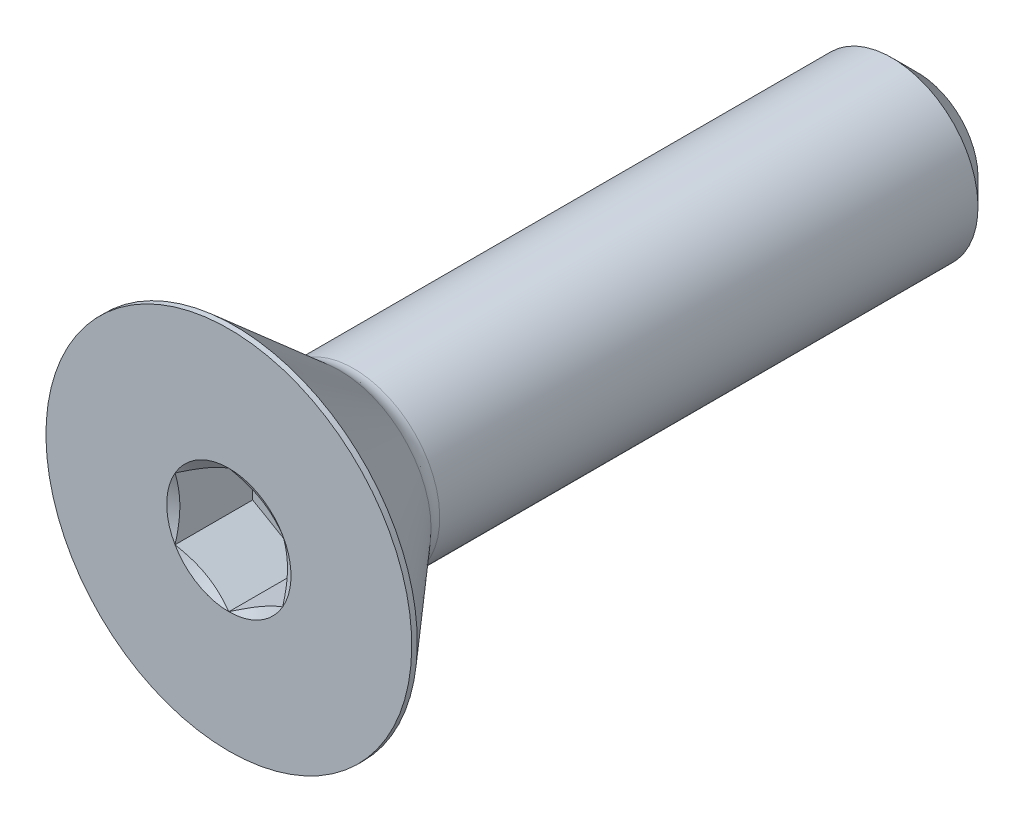
ISO-10303-21;
HEADER;
FILE_DESCRIPTION(('STEP AP214'),'2;1');
FILE_NAME('part.step','',(''),(''),'','','');
FILE_SCHEMA(('AUTOMOTIVE_DESIGN { 1 0 10303 214 1 1 1 1 }'));
ENDSEC;
DATA;
#1=APPLICATION_CONTEXT('core data for automotive mechanical design processes');
#2=APPLICATION_PROTOCOL_DEFINITION('international standard','automotive_design',2000,#1);
#3=PRODUCT_CONTEXT('',#1,'mechanical');
#4=PRODUCT('Part','Part','',(#3));
#5=PRODUCT_RELATED_PRODUCT_CATEGORY('part','',(#4));
#6=PRODUCT_DEFINITION_FORMATION('','',#4);
#7=PRODUCT_DEFINITION_CONTEXT('part definition',#1,'design');
#8=PRODUCT_DEFINITION('design','',#6,#7);
#9=PRODUCT_DEFINITION_SHAPE('','',#8);
#10=(LENGTH_UNIT() NAMED_UNIT(*) SI_UNIT(.MILLI.,.METRE.));
#11=(NAMED_UNIT(*) PLANE_ANGLE_UNIT() SI_UNIT($,.RADIAN.));
#12=(NAMED_UNIT(*) SI_UNIT($,.STERADIAN.) SOLID_ANGLE_UNIT());
#13=UNCERTAINTY_MEASURE_WITH_UNIT(LENGTH_MEASURE(1.E-05),#10,'distance_accuracy_value','');
#14=(GEOMETRIC_REPRESENTATION_CONTEXT(3) GLOBAL_UNCERTAINTY_ASSIGNED_CONTEXT((#13)) GLOBAL_UNIT_ASSIGNED_CONTEXT((#10,
#11,#12)) REPRESENTATION_CONTEXT('',''));
#15=CARTESIAN_POINT('',(0.,0.,0.));
#16=DIRECTION('',(0.,0.,1.));
#17=DIRECTION('',(1.,0.,0.));
#18=AXIS2_PLACEMENT_3D('',#15,#16,#17);
#19=CARTESIAN_POINT('',(0.,0.,-25.4));
#20=DIRECTION('',(0.,0.,-1.));
#21=DIRECTION('',(0.,1.,0.));
#22=AXIS2_PLACEMENT_3D('',#19,#20,#21);
#23=CYLINDRICAL_SURFACE('',#22,3.175);
#24=CARTESIAN_POINT('',(0.,0.,-24.4475));
#25=DIRECTION('',(0.,0.,-1.));
#26=DIRECTION('',(0.,1.,0.));
#27=AXIS2_PLACEMENT_3D('',#24,#25,#26);
#28=CIRCLE('',#27,3.175);
#29=CARTESIAN_POINT('',(0.,-3.175,-24.4475));
#30=VERTEX_POINT('',#29);
#31=EDGE_CURVE('E50',#30,#30,#28,.F.);
#32=ORIENTED_EDGE('',*,*,#31,.T.);
#33=EDGE_LOOP('',(#32));
#34=FACE_BOUND('',#33,.T.);
#35=CARTESIAN_POINT('',(0.,0.,-4.60180899712601));
#36=DIRECTION('',(0.,0.,1.));
#37=DIRECTION('',(0.,-1.,0.));
#38=AXIS2_PLACEMENT_3D('',#35,#36,#37);
#39=CIRCLE('',#38,3.175);
#40=CARTESIAN_POINT('',(0.,-3.175,-4.60180899712601));
#41=VERTEX_POINT('',#40);
#42=EDGE_CURVE('E213',#41,#41,#39,.T.);
#43=ORIENTED_EDGE('',*,*,#42,.F.);
#44=EDGE_LOOP('',(#43));
#45=FACE_BOUND('',#44,.T.);
#46=ADVANCED_FACE('F36',(#34,#45),#23,.T.);
#47=CARTESIAN_POINT('',(0.,-3.175,-25.4));
#48=DIRECTION('',(0.,0.,-1.));
#49=DIRECTION('',(0.,1.,0.));
#50=AXIS2_PLACEMENT_3D('',#47,#48,#49);
#51=PLANE('',#50);
#52=CARTESIAN_POINT('',(0.,0.,-25.4));
#53=DIRECTION('',(0.,0.,-1.));
#54=DIRECTION('',(0.,1.,0.));
#55=AXIS2_PLACEMENT_3D('',#52,#53,#54);
#56=CIRCLE('',#55,2.2225);
#57=CARTESIAN_POINT('',(0.,-2.2225,-25.4));
#58=VERTEX_POINT('',#57);
#59=EDGE_CURVE('E216',#58,#58,#56,.T.);
#60=ORIENTED_EDGE('',*,*,#59,.T.);
#61=EDGE_LOOP('',(#60));
#62=FACE_BOUND('',#61,.T.);
#63=ADVANCED_FACE('F226',(#62),#51,.T.);
#64=CARTESIAN_POINT('',(0.,0.,-25.4));
#65=DIRECTION('',(0.,0.,1.));
#66=DIRECTION('',(0.,-1.,0.));
#67=AXIS2_PLACEMENT_3D('',#64,#65,#66);
#68=CONICAL_SURFACE('',#67,2.2225,0.785398163397447);
#69=CARTESIAN_POINT('',(0.,-3.175,-24.4475));
#70=CARTESIAN_POINT('',(0.,-3.165078125,-24.457421875));
#71=CARTESIAN_POINT('',(0.,-3.15515625,-24.46734375));
#72=CARTESIAN_POINT('',(0.,-3.1353125,-24.4871875));
#73=CARTESIAN_POINT('',(0.,-3.125390625,-24.497109375));
#74=CARTESIAN_POINT('',(0.,-3.105546875,-24.516953125));
#75=CARTESIAN_POINT('',(0.,-3.095625,-24.526875));
#76=CARTESIAN_POINT('',(0.,-3.07578125,-24.54671875));
#77=CARTESIAN_POINT('',(0.,-3.065859375,-24.556640625));
#78=CARTESIAN_POINT('',(0.,-3.046015625,-24.576484375));
#79=CARTESIAN_POINT('',(0.,-3.03609375,-24.58640625));
#80=CARTESIAN_POINT('',(0.,-3.01625,-24.60625));
#81=CARTESIAN_POINT('',(0.,-3.006328125,-24.616171875));
#82=CARTESIAN_POINT('',(0.,-2.986484375,-24.636015625));
#83=CARTESIAN_POINT('',(0.,-2.9765625,-24.6459375));
#84=CARTESIAN_POINT('',(0.,-2.95671875,-24.66578125));
#85=CARTESIAN_POINT('',(0.,-2.946796875,-24.675703125));
#86=CARTESIAN_POINT('',(0.,-2.926953125,-24.695546875));
#87=CARTESIAN_POINT('',(0.,-2.91703125,-24.70546875));
#88=CARTESIAN_POINT('',(0.,-2.8971875,-24.7253125));
#89=CARTESIAN_POINT('',(0.,-2.887265625,-24.735234375));
#90=CARTESIAN_POINT('',(0.,-2.867421875,-24.755078125));
#91=CARTESIAN_POINT('',(0.,-2.8575,-24.765));
#92=CARTESIAN_POINT('',(0.,-2.83765625,-24.78484375));
#93=CARTESIAN_POINT('',(0.,-2.827734375,-24.794765625));
#94=CARTESIAN_POINT('',(0.,-2.807890625,-24.814609375));
#95=CARTESIAN_POINT('',(0.,-2.79796875,-24.82453125));
#96=CARTESIAN_POINT('',(0.,-2.778125,-24.844375));
#97=CARTESIAN_POINT('',(0.,-2.768203125,-24.854296875));
#98=CARTESIAN_POINT('',(0.,-2.748359375,-24.874140625));
#99=CARTESIAN_POINT('',(0.,-2.7384375,-24.8840625));
#100=CARTESIAN_POINT('',(0.,-2.71859375,-24.90390625));
#101=CARTESIAN_POINT('',(0.,-2.708671875,-24.913828125));
#102=CARTESIAN_POINT('',(0.,-2.688828125,-24.933671875));
#103=CARTESIAN_POINT('',(0.,-2.67890625,-24.94359375));
#104=CARTESIAN_POINT('',(0.,-2.6590625,-24.9634375));
#105=CARTESIAN_POINT('',(0.,-2.649140625,-24.973359375));
#106=CARTESIAN_POINT('',(0.,-2.629296875,-24.993203125));
#107=CARTESIAN_POINT('',(0.,-2.619375,-25.003125));
#108=CARTESIAN_POINT('',(0.,-2.59953125,-25.02296875));
#109=CARTESIAN_POINT('',(0.,-2.589609375,-25.032890625));
#110=CARTESIAN_POINT('',(0.,-2.569765625,-25.052734375));
#111=CARTESIAN_POINT('',(0.,-2.55984375,-25.06265625));
#112=CARTESIAN_POINT('',(0.,-2.54,-25.0825));
#113=CARTESIAN_POINT('',(0.,-2.530078125,-25.092421875));
#114=CARTESIAN_POINT('',(0.,-2.510234375,-25.112265625));
#115=CARTESIAN_POINT('',(0.,-2.5003125,-25.1221875));
#116=CARTESIAN_POINT('',(0.,-2.48046875,-25.14203125));
#117=CARTESIAN_POINT('',(0.,-2.470546875,-25.151953125));
#118=CARTESIAN_POINT('',(0.,-2.450703125,-25.171796875));
#119=CARTESIAN_POINT('',(0.,-2.44078125,-25.18171875));
#120=CARTESIAN_POINT('',(0.,-2.4209375,-25.2015625));
#121=CARTESIAN_POINT('',(0.,-2.411015625,-25.211484375));
#122=CARTESIAN_POINT('',(0.,-2.391171875,-25.231328125));
#123=CARTESIAN_POINT('',(0.,-2.38125,-25.24125));
#124=CARTESIAN_POINT('',(0.,-2.36140625,-25.26109375));
#125=CARTESIAN_POINT('',(0.,-2.351484375,-25.271015625));
#126=CARTESIAN_POINT('',(0.,-2.331640625,-25.290859375));
#127=CARTESIAN_POINT('',(0.,-2.32171875,-25.30078125));
#128=CARTESIAN_POINT('',(0.,-2.301875,-25.320625));
#129=CARTESIAN_POINT('',(0.,-2.291953125,-25.330546875));
#130=CARTESIAN_POINT('',(0.,-2.272109375,-25.350390625));
#131=CARTESIAN_POINT('',(0.,-2.2621875,-25.3603125));
#132=CARTESIAN_POINT('',(0.,-2.24234375,-25.38015625));
#133=CARTESIAN_POINT('',(0.,-2.232421875,-25.390078125));
#134=CARTESIAN_POINT('',(0.,-2.2225,-25.4));
#135=B_SPLINE_CURVE_WITH_KNOTS('',3,(#69,#70,#71,#72,#73,#74,#75,#76,#77,#78,#79,#80,#81,#82,
#83,#84,#85,#86,#87,#88,#89,#90,#91,#92,#93,#94,#95,#96,#97,#98,#99,#100,#101,#102,#103,#104,
#105,#106,#107,#108,#109,#110,#111,#112,#113,#114,#115,#116,#117,#118,#119,#120,#121,#122,#123,
#124,#125,#126,#127,#128,#129,#130,#131,#132,#133,#134),.UNSPECIFIED.,.F.,.F.,(4,2,2,2,2,2,2,2,
2,2,2,2,2,2,2,2,2,2,2,2,2,2,2,2,2,2,2,2,2,2,2,2,4),(0.,0.0420949505675096,0.0841899011350216,
0.126284851702534,0.168379802270046,0.210474752837558,0.252569703405068,0.29466465397258,
0.336759604540092,0.378854555107604,0.420949505675116,0.463044456242626,0.505139406810138,
0.54723435737765,0.589329307945162,0.631424258512675,0.673519209080187,0.715614159647697,
0.757709110215209,0.799804060782721,0.841899011350233,0.883993961917745,0.926088912485255,
0.968183863052767,1.01027881362028,1.05237376418779,1.0944687147553,1.13656366532281,
1.17865861589032,1.22075356645784,1.26284851702535,1.30494346759286,1.34703841816037),.UNSPECIFIED.);
#136=EDGE_CURVE('BSEAM38',#30,#58,#135,.T.);
#137=ORIENTED_EDGE('',*,*,#31,.F.);
#138=ORIENTED_EDGE('',*,*,#59,.F.);
#139=ORIENTED_EDGE('',*,*,#136,.T.);
#140=ORIENTED_EDGE('',*,*,#136,.F.);
#141=EDGE_LOOP('',(#137,#139,#138,#140));
#142=FACE_BOUND('',#141,.T.);
#143=ADVANCED_FACE('F38',(#142),#68,.T.);
#144=CARTESIAN_POINT('',(0.,0.,-4.60180899712601));
#145=DIRECTION('',(0.,0.,1.));
#146=DIRECTION('',(0.,-1.,0.));
#147=AXIS2_PLACEMENT_3D('',#144,#145,#146);
#148=TOROIDAL_SURFACE('',#147,3.95604099552516,0.781040995525161);
#149=CARTESIAN_POINT('',(0.,0.,-4.0894));
#150=DIRECTION('',(0.,0.,1.));
#151=DIRECTION('',(0.,-1.,0.));
#152=AXIS2_PLACEMENT_3D('',#149,#150,#151);
#153=CIRCLE('',#152,3.36658187365559);
#154=CARTESIAN_POINT('',(0.,-3.36658187365559,-4.0894));
#155=VERTEX_POINT('',#154);
#156=EDGE_CURVE('E210',#155,#155,#153,.T.);
#157=ORIENTED_EDGE('',*,*,#156,.F.);
#158=EDGE_LOOP('',(#157));
#159=FACE_BOUND('',#158,.T.);
#160=ORIENTED_EDGE('',*,*,#42,.T.);
#161=EDGE_LOOP('',(#160));
#162=FACE_BOUND('',#161,.T.);
#163=ADVANCED_FACE('F225',(#159,#162),#148,.F.);
#164=CARTESIAN_POINT('',(0.,0.,-4.0894));
#165=DIRECTION('',(0.,0.,1.));
#166=DIRECTION('',(0.,-1.,0.));
#167=AXIS2_PLACEMENT_3D('',#164,#165,#166);
#168=CONICAL_SURFACE('',#167,3.36658187365559,0.715584993317677);
#169=CARTESIAN_POINT('',(0.,0.,-0.204469999999999));
#170=DIRECTION('',(0.,0.,1.));
#171=DIRECTION('',(0.,-1.,0.));
#172=AXIS2_PLACEMENT_3D('',#169,#170,#171);
#173=CIRCLE('',#172,6.7437);
#174=CARTESIAN_POINT('',(0.,-6.7437,-0.204469999999999));
#175=VERTEX_POINT('',#174);
#176=EDGE_CURVE('E207',#175,#175,#173,.T.);
#177=ORIENTED_EDGE('',*,*,#176,.F.);
#178=EDGE_LOOP('',(#177));
#179=FACE_BOUND('',#178,.T.);
#180=ORIENTED_EDGE('',*,*,#156,.T.);
#181=EDGE_LOOP('',(#180));
#182=FACE_BOUND('',#181,.T.);
#183=ADVANCED_FACE('F238',(#179,#182),#168,.T.);
#184=CARTESIAN_POINT('',(0.,0.,0.));
#185=DIRECTION('',(0.,0.,1.));
#186=DIRECTION('',(0.,-1.,0.));
#187=AXIS2_PLACEMENT_3D('',#184,#185,#186);
#188=CYLINDRICAL_SURFACE('',#187,6.7437);
#189=CARTESIAN_POINT('',(0.,0.,0.));
#190=DIRECTION('',(0.,0.,1.));
#191=DIRECTION('',(0.,-1.,0.));
#192=AXIS2_PLACEMENT_3D('',#189,#190,#191);
#193=CIRCLE('',#192,6.7437);
#194=CARTESIAN_POINT('',(0.,-6.7437,0.));
#195=VERTEX_POINT('',#194);
#196=EDGE_CURVE('E195',#195,#195,#193,.T.);
#197=ORIENTED_EDGE('',*,*,#196,.F.);
#198=EDGE_LOOP('',(#197));
#199=FACE_BOUND('',#198,.T.);
#200=ORIENTED_EDGE('',*,*,#176,.T.);
#201=EDGE_LOOP('',(#200));
#202=FACE_BOUND('',#201,.T.);
#203=ADVANCED_FACE('F168',(#199,#202),#188,.T.);
#204=CARTESIAN_POINT('',(0.,-3.175,0.));
#205=DIRECTION('',(0.,0.,1.));
#206=DIRECTION('',(0.,-1.,0.));
#207=AXIS2_PLACEMENT_3D('',#204,#205,#206);
#208=PLANE('',#207);
#209=CARTESIAN_POINT('',(0.,0.,0.));
#210=DIRECTION('',(0.,0.,1.));
#211=DIRECTION('',(1.,0.,0.));
#212=AXIS2_PLACEMENT_3D('',#209,#210,#211);
#213=CIRCLE('',#212,2.29135888084633);
#214=CARTESIAN_POINT('',(0.,-2.29135888084633,0.));
#215=VERTEX_POINT('',#214);
#216=CARTESIAN_POINT('',(1.984375,-1.14567944042316,0.));
#217=VERTEX_POINT('',#216);
#218=EDGE_CURVE('E63',#215,#217,#213,.T.);
#219=ORIENTED_EDGE('',*,*,#218,.F.);
#220=CARTESIAN_POINT('',(-1.984375,-1.14567944042316,0.));
#221=VERTEX_POINT('',#220);
#222=EDGE_CURVE('E135',#221,#215,#213,.T.);
#223=ORIENTED_EDGE('',*,*,#222,.F.);
#224=CARTESIAN_POINT('',(-1.984375,1.14567944042317,0.));
#225=VERTEX_POINT('',#224);
#226=EDGE_CURVE('E134',#225,#221,#213,.T.);
#227=ORIENTED_EDGE('',*,*,#226,.F.);
#228=CARTESIAN_POINT('',(0.,2.29135888084633,0.));
#229=VERTEX_POINT('',#228);
#230=EDGE_CURVE('E104',#229,#225,#213,.T.);
#231=ORIENTED_EDGE('',*,*,#230,.F.);
#232=CARTESIAN_POINT('',(1.984375,1.14567944042316,0.));
#233=VERTEX_POINT('',#232);
#234=EDGE_CURVE('E95',#233,#229,#213,.T.);
#235=ORIENTED_EDGE('',*,*,#234,.F.);
#236=EDGE_CURVE('E56',#217,#233,#213,.T.);
#237=ORIENTED_EDGE('',*,*,#236,.F.);
#238=EDGE_LOOP('',(#219,#223,#227,#231,#235,#237));
#239=FACE_BOUND('',#238,.T.);
#240=ORIENTED_EDGE('',*,*,#196,.T.);
#241=EDGE_LOOP('',(#240));
#242=FACE_BOUND('',#241,.T.);
#243=ADVANCED_FACE('F130',(#239,#242),#208,.T.);
#244=CARTESIAN_POINT('',(0.,0.,0.));
#245=DIRECTION('',(0.,0.,1.));
#246=DIRECTION('',(1.,0.,0.));
#247=AXIS2_PLACEMENT_3D('',#244,#245,#246);
#248=CONICAL_SURFACE('',#247,2.29135888084633,1.0471975511966);
#249=ORIENTED_EDGE('',*,*,#230,.T.);
#250=CARTESIAN_POINT('',(0.000199999999999609,2.29147435090017,6.66717057831416E-05));
#251=CARTESIAN_POINT('',(-0.0870046387806768,2.24112672922556,-0.029014317759813));
#252=CARTESIAN_POINT('',(-0.174962019304997,2.19034451190263,-0.0554627919729485));
#253=CARTESIAN_POINT('',(-0.35239997867232,2.08790065829745,-0.101629728793529));
#254=CARTESIAN_POINT('',(-0.441883711256319,2.03623720120198,-0.121331857751036));
#255=CARTESIAN_POINT('',(-0.619742148012469,1.93355058486317,-0.152002268068471));
#256=CARTESIAN_POINT('',(-0.708089480306094,1.88254322878126,-0.163174657279787));
#257=CARTESIAN_POINT('',(-0.88520002811095,1.78028840632981,-0.176514203945575));
#258=CARTESIAN_POINT('',(-0.973962599510547,1.72904131183829,-0.178692405539878));
#259=CARTESIAN_POINT('',(-1.13983230286466,1.63327639395638,-0.174170448491651));
#260=CARTESIAN_POINT('',(-1.21696421566591,1.58874426333747,-0.168580586544127));
#261=CARTESIAN_POINT('',(-1.37072550718908,1.49997014028563,-0.150861066102989));
#262=CARTESIAN_POINT('',(-1.44735435374552,1.45572845509857,-0.138725349670475));
#263=CARTESIAN_POINT('',(-1.60143288850678,1.36677117157782,-0.108385841155635));
#264=CARTESIAN_POINT('',(-1.67886306721268,1.32206683705857,-0.09005339070901));
#265=CARTESIAN_POINT('',(-1.83256831124359,1.23332507304146,-0.0484454935998176));
#266=CARTESIAN_POINT('',(-1.90884534705293,1.18928650588395,-0.0251798287176209));
#267=CARTESIAN_POINT('',(-1.984575,1.14556397036933,6.66717057829762E-05));
#268=B_SPLINE_CURVE_WITH_KNOTS('',3,(#250,#251,#252,#253,#254,#255,#256,#257,#258,#259,#260,
#261,#262,#263,#264,#265,#266,#267),.UNSPECIFIED.,.F.,.F.,(4,2,2,2,2,2,2,2,4),(0.,
0.314555137114086,0.629866549668806,0.937373439505933,1.24450262309398,1.51196650590478,
1.77967834211415,2.05332989762155,2.32644383656793),.UNSPECIFIED.);
#269=EDGE_CURVE('E11',#229,#225,#268,.T.);
#270=ORIENTED_EDGE('',*,*,#269,.F.);
#271=EDGE_LOOP('',(#249,#270));
#272=FACE_BOUND('',#271,.T.);
#273=ADVANCED_FACE('F108',(#272),#248,.F.);
#274=ORIENTED_EDGE('',*,*,#226,.T.);
#275=CARTESIAN_POINT('',(-1.984375,-2.96692860034507,0.737860651092377));
#276=CARTESIAN_POINT('',(-1.984375,-2.88123645369667,0.69674880177529));
#277=CARTESIAN_POINT('',(-1.984375,-2.79533554929687,0.656063972956056));
#278=CARTESIAN_POINT('',(-1.984375,-2.62300496253372,0.575790597945192));
#279=CARTESIAN_POINT('',(-1.984375,-2.53657518838115,0.536202249047077));
#280=CARTESIAN_POINT('',(-1.984375,-2.36258003650985,0.458142914429596));
#281=CARTESIAN_POINT('',(-1.984375,-2.27501095051754,0.419680163398946));
#282=CARTESIAN_POINT('',(-1.984375,-2.09913795632987,0.344479427097519));
#283=CARTESIAN_POINT('',(-1.984375,-2.01083408662377,0.307741352146445));
#284=CARTESIAN_POINT('',(-1.984375,-1.83102497893539,0.235513729354963));
#285=CARTESIAN_POINT('',(-1.984375,-1.73949640320228,0.200081939073892));
#286=CARTESIAN_POINT('',(-1.984375,-1.55533214713673,0.132164183556778));
#287=CARTESIAN_POINT('',(-1.984375,-1.46269633980312,0.0996785599926462));
#288=CARTESIAN_POINT('',(-1.984375,-1.27638419434466,0.0385821363592113));
#289=CARTESIAN_POINT('',(-1.984375,-1.18271082678456,0.00996237523819853));
#290=CARTESIAN_POINT('',(-1.984375,-0.994021652382587,-0.0424236311394211));
#291=CARTESIAN_POINT('',(-1.984375,-0.899006185229732,-0.0661910818015453));
#292=CARTESIAN_POINT('',(-1.984375,-0.70783051245842,-0.107605260619429));
#293=CARTESIAN_POINT('',(-1.984375,-0.611673084373239,-0.125264559933971));
#294=CARTESIAN_POINT('',(-1.984375,-0.418283092113672,-0.153306903466505));
#295=CARTESIAN_POINT('',(-1.984375,-0.32105060104525,-0.163690439394072));
#296=CARTESIAN_POINT('',(-1.984375,-0.127210752774483,-0.176214799009401));
#297=CARTESIAN_POINT('',(-1.984375,-0.0306098639781231,-0.178452892631436));
#298=CARTESIAN_POINT('',(-1.984375,0.162431915887106,-0.17475795296783));
#299=CARTESIAN_POINT('',(-1.984375,0.258872796678698,-0.168824413724938));
#300=CARTESIAN_POINT('',(-1.984375,0.496826477184735,-0.144624426308478));
#301=CARTESIAN_POINT('',(-1.984375,0.637878211825128,-0.121822779785831));
#302=CARTESIAN_POINT('',(-1.984375,0.91723870370253,-0.0630239757386336));
#303=CARTESIAN_POINT('',(-1.984375,1.05554394232965,-0.0270109144574765));
#304=CARTESIAN_POINT('',(-1.984375,1.26239464896717,0.0345082078903479));
#305=CARTESIAN_POINT('',(-1.984375,1.33200934564274,0.0565514264145546));
#306=CARTESIAN_POINT('',(-1.984375,1.47051409380588,0.102676986257499));
#307=CARTESIAN_POINT('',(-1.984375,1.53940456776433,0.126758055006123));
#308=CARTESIAN_POINT('',(-1.984375,1.67655293465251,0.176609588689456));
#309=CARTESIAN_POINT('',(-1.984375,1.74481093998431,0.202379746602285));
#310=CARTESIAN_POINT('',(-1.984375,1.88078910071683,0.255330712681564));
#311=CARTESIAN_POINT('',(-1.984375,1.94850916300286,0.282511759182964));
#312=CARTESIAN_POINT('',(-1.984375,2.12136731788458,0.353633623835928));
#313=CARTESIAN_POINT('',(-1.984375,2.22615977384556,0.398413596701326));
#314=CARTESIAN_POINT('',(-1.984375,2.43479837304527,0.490132195682473));
#315=CARTESIAN_POINT('',(-1.984375,2.5386444446916,0.537070983511256));
#316=CARTESIAN_POINT('',(-1.984375,2.84907841644385,0.680364561323518));
#317=CARTESIAN_POINT('',(-1.984375,3.05452739791262,0.77918187526435));
#318=CARTESIAN_POINT('',(-1.984375,3.46367014223902,0.980960885724764));
#319=CARTESIAN_POINT('',(-1.984375,3.66736143684958,1.08392752775299));
#320=CARTESIAN_POINT('',(-1.984375,4.07334844866211,1.29250841655482));
#321=CARTESIAN_POINT('',(-1.984375,4.27564433912763,1.39812232679349));
#322=CARTESIAN_POINT('',(-1.984375,4.66022184962415,1.60111933686162));
#323=CARTESIAN_POINT('',(-1.984375,4.84259034249047,1.69833842729249));
#324=CARTESIAN_POINT('',(-1.984375,5.20674070245669,1.89388432048827));
#325=CARTESIAN_POINT('',(-1.984375,5.38852254752481,1.99221116424656));
#326=CARTESIAN_POINT('',(-1.984375,5.75117247931181,2.18944361750704));
#327=CARTESIAN_POINT('',(-1.984375,5.93204171415673,2.2883471187779));
#328=CARTESIAN_POINT('',(-1.984375,6.29341450955436,2.48679783989033));
#329=CARTESIAN_POINT('',(-1.984375,6.47391808874828,2.5863450257738));
#330=CARTESIAN_POINT('',(-1.984375,6.6542902961452,2.6861282522634));
#331=B_SPLINE_CURVE_WITH_KNOTS('',3,(#275,#276,#277,#278,#279,#280,#281,#282,#283,#284,#285,
#286,#287,#288,#289,#290,#291,#292,#293,#294,#295,#296,#297,#298,#299,#300,#301,#302,#303,#304,
#305,#306,#307,#308,#309,#310,#311,#312,#313,#314,#315,#316,#317,#318,#319,#320,#321,#322,#323,
#324,#325,#326,#327,#328,#329,#330),.UNSPECIFIED.,.F.,.F.,(4,2,2,2,2,2,2,2,2,2,2,2,2,2,2,2,2,2,
2,2,2,2,2,2,2,2,2,4),(0.,0.285135519832373,0.570322016122788,0.857238463819792,1.14413997577449,
1.43854271801315,1.7329795590899,2.02672173491208,2.32039085060263,2.61345191984504,
2.90649318156653,3.19602335108128,3.48557144803805,3.91334047285799,4.34162614021154,
4.56066589824458,4.77956986852721,4.99843415889189,5.21733554208811,5.55917796423187,
5.90104603503021,6.58489509249957,7.26958483186157,7.95418796687477,8.57417425374278,
9.1941835596094,9.81261585701217,10.431015790458),.UNSPECIFIED.);
#332=EDGE_CURVE('E103',#225,#221,#331,.F.);
#333=ORIENTED_EDGE('',*,*,#332,.F.);
#334=EDGE_LOOP('',(#274,#333));
#335=FACE_BOUND('',#334,.T.);
#336=ADVANCED_FACE('F266',(#335),#248,.F.);
#337=ORIENTED_EDGE('',*,*,#222,.T.);
#338=CARTESIAN_POINT('',(-1.984575,-1.14556397036933,6.66717057829649E-05));
#339=CARTESIAN_POINT('',(-1.89737036121932,-1.19591159204393,-0.0290143177598132));
#340=CARTESIAN_POINT('',(-1.809412980695,-1.24669380936686,-0.0554627919729487));
#341=CARTESIAN_POINT('',(-1.63197502132768,-1.34913766297205,-0.101629728793529));
#342=CARTESIAN_POINT('',(-1.54249128874368,-1.40080112006751,-0.121331857751037));
#343=CARTESIAN_POINT('',(-1.36463285198753,-1.50348773640632,-0.152002268068471));
#344=CARTESIAN_POINT('',(-1.27628551969391,-1.55449509248823,-0.163174657279787));
#345=CARTESIAN_POINT('',(-1.09917497188905,-1.65674991493968,-0.176514203945575));
#346=CARTESIAN_POINT('',(-1.01041240048945,-1.70799700943121,-0.178692405539878));
#347=CARTESIAN_POINT('',(-0.844542697135338,-1.80376192731311,-0.174170448491652));
#348=CARTESIAN_POINT('',(-0.767410784334093,-1.84829405793202,-0.168580586544128));
#349=CARTESIAN_POINT('',(-0.613649492810919,-1.93706818098387,-0.150861066102989));
#350=CARTESIAN_POINT('',(-0.537020646254476,-1.98130986617092,-0.138725349670476));
#351=CARTESIAN_POINT('',(-0.382942111493217,-2.07026714969167,-0.108385841155636));
#352=CARTESIAN_POINT('',(-0.305511932787318,-2.11497148421093,-0.0900533907090107));
#353=CARTESIAN_POINT('',(-0.151806688756412,-2.20371324822803,-0.0484454935998183));
#354=CARTESIAN_POINT('',(-0.075529652947068,-2.24775181538554,-0.0251798287176216));
#355=CARTESIAN_POINT('',(0.000199999999999772,-2.29147435090016,6.66717057822253E-05));
#356=B_SPLINE_CURVE_WITH_KNOTS('',3,(#338,#339,#340,#341,#342,#343,#344,#345,#346,#347,#348,
#349,#350,#351,#352,#353,#354,#355),.UNSPECIFIED.,.F.,.F.,(4,2,2,2,2,2,2,2,4),(0.,
0.314555137114086,0.629866549668806,0.937373439505932,1.24450262309398,1.51196650590478,
1.77967834211415,2.05332989762155,2.32644383656793),.UNSPECIFIED.);
#357=EDGE_CURVE('E144',#221,#215,#356,.T.);
#358=ORIENTED_EDGE('',*,*,#357,.F.);
#359=EDGE_LOOP('',(#337,#358));
#360=FACE_BOUND('',#359,.T.);
#361=ADVANCED_FACE('F272',(#360),#248,.F.);
#362=ORIENTED_EDGE('',*,*,#218,.T.);
#363=CARTESIAN_POINT('',(-0.000200000000000051,-2.29147435090016,6.66717057826408E-05));
#364=CARTESIAN_POINT('',(0.0870046387806763,-2.24112672922556,-0.0290143177598132));
#365=CARTESIAN_POINT('',(0.174962019304996,-2.19034451190263,-0.0554627919729487));
#366=CARTESIAN_POINT('',(0.352399978672319,-2.08790065829744,-0.101629728793529));
#367=CARTESIAN_POINT('',(0.441883711256319,-2.03623720120198,-0.121331857751037));
#368=CARTESIAN_POINT('',(0.619742148012468,-1.93355058486317,-0.152002268068471));
#369=CARTESIAN_POINT('',(0.708089480306093,-1.88254322878126,-0.163174657279787));
#370=CARTESIAN_POINT('',(0.885200028110949,-1.78028840632981,-0.176514203945575));
#371=CARTESIAN_POINT('',(0.973962599510546,-1.72904131183829,-0.178692405539878));
#372=CARTESIAN_POINT('',(1.13983230286466,-1.63327639395638,-0.174170448491652));
#373=CARTESIAN_POINT('',(1.21696421566591,-1.58874426333747,-0.168580586544128));
#374=CARTESIAN_POINT('',(1.37072550718908,-1.49997014028563,-0.150861066102989));
#375=CARTESIAN_POINT('',(1.44735435374552,-1.45572845509857,-0.138725349670476));
#376=CARTESIAN_POINT('',(1.60143288850678,-1.36677117157782,-0.108385841155636));
#377=CARTESIAN_POINT('',(1.67886306721268,-1.32206683705856,-0.0900533907090105));
#378=CARTESIAN_POINT('',(1.83256831124359,-1.23332507304146,-0.0484454935998179));
#379=CARTESIAN_POINT('',(1.90884534705293,-1.18928650588395,-0.0251798287176211));
#380=CARTESIAN_POINT('',(1.984575,-1.14556397036933,6.66717057827258E-05));
#381=B_SPLINE_CURVE_WITH_KNOTS('',3,(#363,#364,#365,#366,#367,#368,#369,#370,#371,#372,#373,
#374,#375,#376,#377,#378,#379,#380),.UNSPECIFIED.,.F.,.F.,(4,2,2,2,2,2,2,2,4),(0.,
0.314555137114085,0.629866549668806,0.937373439505932,1.24450262309398,1.51196650590478,
1.77967834211415,2.05332989762155,2.32644383656793),.UNSPECIFIED.);
#382=EDGE_CURVE('E422',#215,#217,#381,.T.);
#383=ORIENTED_EDGE('',*,*,#382,.F.);
#384=EDGE_LOOP('',(#362,#383));
#385=FACE_BOUND('',#384,.T.);
#386=ADVANCED_FACE('F279',(#385),#248,.F.);
#387=ORIENTED_EDGE('',*,*,#236,.T.);
#388=CARTESIAN_POINT('',(1.984375,-2.96692860034507,0.737860651092378));
#389=CARTESIAN_POINT('',(1.984375,-2.88123645369666,0.69674880177529));
#390=CARTESIAN_POINT('',(1.984375,-2.79533554929687,0.656063972956056));
#391=CARTESIAN_POINT('',(1.984375,-2.62300496253372,0.575790597945192));
#392=CARTESIAN_POINT('',(1.984375,-2.53657518838115,0.536202249047077));
#393=CARTESIAN_POINT('',(1.984375,-2.36258003650985,0.458142914429596));
#394=CARTESIAN_POINT('',(1.984375,-2.27501095051754,0.419680163398946));
#395=CARTESIAN_POINT('',(1.984375,-2.09913795632987,0.344479427097519));
#396=CARTESIAN_POINT('',(1.984375,-2.01083408662377,0.307741352146445));
#397=CARTESIAN_POINT('',(1.984375,-1.83102497893539,0.235513729354964));
#398=CARTESIAN_POINT('',(1.984375,-1.73949640320228,0.200081939073892));
#399=CARTESIAN_POINT('',(1.984375,-1.55533214713673,0.132164183556778));
#400=CARTESIAN_POINT('',(1.984375,-1.46269633980312,0.0996785599926464));
#401=CARTESIAN_POINT('',(1.984375,-1.27638419434466,0.0385821363592116));
#402=CARTESIAN_POINT('',(1.984375,-1.18271082678456,0.00996237523819882));
#403=CARTESIAN_POINT('',(1.984375,-0.994021652382587,-0.042423631139421));
#404=CARTESIAN_POINT('',(1.984375,-0.899006185229731,-0.0661910818015453));
#405=CARTESIAN_POINT('',(1.984375,-0.70783051245842,-0.107605260619429));
#406=CARTESIAN_POINT('',(1.984375,-0.611673084373239,-0.125264559933971));
#407=CARTESIAN_POINT('',(1.984375,-0.418283092113671,-0.153306903466505));
#408=CARTESIAN_POINT('',(1.984375,-0.32105060104525,-0.163690439394072));
#409=CARTESIAN_POINT('',(1.984375,-0.127210752774482,-0.176214799009401));
#410=CARTESIAN_POINT('',(1.984375,-0.0306098639781227,-0.178452892631436));
#411=CARTESIAN_POINT('',(1.984375,0.162431915887107,-0.17475795296783));
#412=CARTESIAN_POINT('',(1.984375,0.258872796678699,-0.168824413724938));
#413=CARTESIAN_POINT('',(1.984375,0.496826477184735,-0.144624426308478));
#414=CARTESIAN_POINT('',(1.984375,0.637878211825129,-0.12182277978583));
#415=CARTESIAN_POINT('',(1.984375,0.91723870370253,-0.0630239757386333));
#416=CARTESIAN_POINT('',(1.984375,1.05554394232965,-0.0270109144574763));
#417=CARTESIAN_POINT('',(1.984375,1.26239464896717,0.0345082078903483));
#418=CARTESIAN_POINT('',(1.984375,1.33200934564274,0.0565514264145553));
#419=CARTESIAN_POINT('',(1.984375,1.47051409380588,0.1026769862575));
#420=CARTESIAN_POINT('',(1.984375,1.53940456776433,0.126758055006124));
#421=CARTESIAN_POINT('',(1.984375,1.67655293465251,0.176609588689457));
#422=CARTESIAN_POINT('',(1.984375,1.74481093998432,0.202379746602286));
#423=CARTESIAN_POINT('',(1.984375,1.88078910071683,0.255330712681565));
#424=CARTESIAN_POINT('',(1.984375,1.94850916300287,0.282511759182965));
#425=CARTESIAN_POINT('',(1.984375,2.12136731788458,0.353633623835929));
#426=CARTESIAN_POINT('',(1.984375,2.22615977384557,0.398413596701327));
#427=CARTESIAN_POINT('',(1.984375,2.43479837304527,0.490132195682473));
#428=CARTESIAN_POINT('',(1.984375,2.5386444446916,0.537070983511257));
#429=CARTESIAN_POINT('',(1.984375,2.84907841644385,0.680364561323519));
#430=CARTESIAN_POINT('',(1.984375,3.05452739791262,0.779181875264351));
#431=CARTESIAN_POINT('',(1.984375,3.46367014223902,0.980960885724765));
#432=CARTESIAN_POINT('',(1.984375,3.66736143684958,1.08392752775299));
#433=CARTESIAN_POINT('',(1.984375,4.07334844866211,1.29250841655482));
#434=CARTESIAN_POINT('',(1.984375,4.27564433912763,1.3981223267935));
#435=CARTESIAN_POINT('',(1.984375,4.66022184962416,1.60111933686162));
#436=CARTESIAN_POINT('',(1.984375,4.84259034249048,1.6983384272925));
#437=CARTESIAN_POINT('',(1.984375,5.2067407024567,1.89388432048827));
#438=CARTESIAN_POINT('',(1.984375,5.38852254752481,1.99221116424656));
#439=CARTESIAN_POINT('',(1.984375,5.75117247931181,2.18944361750704));
#440=CARTESIAN_POINT('',(1.984375,5.93204171415673,2.2883471187779));
#441=CARTESIAN_POINT('',(1.984375,6.29341450955436,2.48679783989034));
#442=CARTESIAN_POINT('',(1.984375,6.47391808874828,2.5863450257738));
#443=CARTESIAN_POINT('',(1.984375,6.6542902961452,2.6861282522634));
#444=B_SPLINE_CURVE_WITH_KNOTS('',3,(#388,#389,#390,#391,#392,#393,#394,#395,#396,#397,#398,
#399,#400,#401,#402,#403,#404,#405,#406,#407,#408,#409,#410,#411,#412,#413,#414,#415,#416,#417,
#418,#419,#420,#421,#422,#423,#424,#425,#426,#427,#428,#429,#430,#431,#432,#433,#434,#435,#436,
#437,#438,#439,#440,#441,#442,#443),.UNSPECIFIED.,.F.,.F.,(4,2,2,2,2,2,2,2,2,2,2,2,2,2,2,2,2,2,
2,2,2,2,2,2,2,2,2,4),(0.,0.285135519832374,0.570322016122787,0.857238463819791,1.14413997577449,
1.43854271801315,1.7329795590899,2.02672173491208,2.32039085060263,2.61345191984504,
2.90649318156653,3.19602335108128,3.48557144803805,3.91334047285799,4.34162614021154,
4.56066589824458,4.77956986852721,4.9984341588919,5.21733554208812,5.55917796423187,
5.90104603503021,6.58489509249957,7.26958483186157,7.95418796687478,8.57417425374278,
9.1941835596094,9.81261585701217,10.431015790458),.UNSPECIFIED.);
#445=EDGE_CURVE('E120',#217,#233,#444,.T.);
#446=ORIENTED_EDGE('',*,*,#445,.F.);
#447=EDGE_LOOP('',(#387,#446));
#448=FACE_BOUND('',#447,.T.);
#449=ADVANCED_FACE('F286',(#448),#248,.F.);
#450=ORIENTED_EDGE('',*,*,#234,.T.);
#451=CARTESIAN_POINT('',(1.984575,1.14556397036933,6.66717057832154E-05));
#452=CARTESIAN_POINT('',(1.89737036121932,1.19591159204393,-0.029014317759813));
#453=CARTESIAN_POINT('',(1.809412980695,1.24669380936687,-0.0554627919729485));
#454=CARTESIAN_POINT('',(1.63197502132768,1.34913766297205,-0.101629728793529));
#455=CARTESIAN_POINT('',(1.54249128874368,1.40080112006751,-0.121331857751036));
#456=CARTESIAN_POINT('',(1.36463285198753,1.50348773640632,-0.152002268068471));
#457=CARTESIAN_POINT('',(1.27628551969391,1.55449509248823,-0.163174657279786));
#458=CARTESIAN_POINT('',(1.09917497188905,1.65674991493969,-0.176514203945575));
#459=CARTESIAN_POINT('',(1.01041240048945,1.70799700943121,-0.178692405539878));
#460=CARTESIAN_POINT('',(0.844542697135338,1.80376192731311,-0.174170448491651));
#461=CARTESIAN_POINT('',(0.767410784334093,1.84829405793202,-0.168580586544127));
#462=CARTESIAN_POINT('',(0.613649492810919,1.93706818098387,-0.150861066102989));
#463=CARTESIAN_POINT('',(0.537020646254476,1.98130986617092,-0.138725349670475));
#464=CARTESIAN_POINT('',(0.382942111493217,2.07026714969167,-0.108385841155635));
#465=CARTESIAN_POINT('',(0.305511932787317,2.11497148421093,-0.0900533907090102));
#466=CARTESIAN_POINT('',(0.151806688756411,2.20371324822803,-0.0484454935998178));
#467=CARTESIAN_POINT('',(0.0755296529470672,2.24775181538554,-0.0251798287176211));
#468=CARTESIAN_POINT('',(-0.000200000000000537,2.29147435090017,6.6671705782726E-05));
#469=B_SPLINE_CURVE_WITH_KNOTS('',3,(#451,#452,#453,#454,#455,#456,#457,#458,#459,#460,#461,
#462,#463,#464,#465,#466,#467,#468),.UNSPECIFIED.,.F.,.F.,(4,2,2,2,2,2,2,2,4),(0.,
0.314555137114086,0.629866549668806,0.937373439505933,1.24450262309398,1.51196650590478,
1.77967834211415,2.05332989762155,2.32644383656793),.UNSPECIFIED.);
#470=EDGE_CURVE('E99',#233,#229,#469,.T.);
#471=ORIENTED_EDGE('',*,*,#470,.F.);
#472=EDGE_LOOP('',(#450,#471));
#473=FACE_BOUND('',#472,.T.);
#474=ADVANCED_FACE('F97',(#473),#248,.F.);
#475=CARTESIAN_POINT('',(0.,2.29135888084633,-2.86258));
#476=DIRECTION('',(0.,0.,1.));
#477=DIRECTION('',(1.,0.,0.));
#478=AXIS2_PLACEMENT_3D('',#475,#476,#477);
#479=PLANE('',#478);
#480=DIRECTION('',(-0.866025403784439,0.5,0.));
#481=VECTOR('',#480,1.);
#482=CARTESIAN_POINT('',(1.984375,1.14567944042317,-2.86258));
#483=LINE('',#482,#481);
#484=CARTESIAN_POINT('',(1.984375,1.14567944042317,-2.86258));
#485=VERTEX_POINT('',#484);
#486=CARTESIAN_POINT('',(0.,2.29135888084633,-2.86258));
#487=VERTEX_POINT('',#486);
#488=EDGE_CURVE('E119',#485,#487,#483,.T.);
#489=ORIENTED_EDGE('',*,*,#488,.T.);
#490=DIRECTION('',(-0.866025403784439,-0.5,0.));
#491=VECTOR('',#490,1.);
#492=CARTESIAN_POINT('',(0.,2.29135888084633,-2.86258));
#493=LINE('',#492,#491);
#494=CARTESIAN_POINT('',(-1.984375,1.14567944042316,-2.86258));
#495=VERTEX_POINT('',#494);
#496=EDGE_CURVE('E124',#487,#495,#493,.T.);
#497=ORIENTED_EDGE('',*,*,#496,.T.);
#498=DIRECTION('',(0.,-1.,0.));
#499=VECTOR('',#498,1.);
#500=CARTESIAN_POINT('',(-1.984375,1.14567944042316,-2.86258));
#501=LINE('',#500,#499);
#502=CARTESIAN_POINT('',(-1.984375,-1.14567944042316,-2.86258));
#503=VERTEX_POINT('',#502);
#504=EDGE_CURVE('E183',#495,#503,#501,.T.);
#505=ORIENTED_EDGE('',*,*,#504,.T.);
#506=DIRECTION('',(0.866025403784439,-0.5,0.));
#507=VECTOR('',#506,1.);
#508=CARTESIAN_POINT('',(-1.984375,-1.14567944042316,-2.86258));
#509=LINE('',#508,#507);
#510=CARTESIAN_POINT('',(0.,-2.29135888084633,-2.86258));
#511=VERTEX_POINT('',#510);
#512=EDGE_CURVE('E186',#503,#511,#509,.T.);
#513=ORIENTED_EDGE('',*,*,#512,.T.);
#514=DIRECTION('',(0.866025403784439,0.5,0.));
#515=VECTOR('',#514,1.);
#516=CARTESIAN_POINT('',(0.,-2.29135888084633,-2.86258));
#517=LINE('',#516,#515);
#518=CARTESIAN_POINT('',(1.984375,-1.14567944042316,-2.86258));
#519=VERTEX_POINT('',#518);
#520=EDGE_CURVE('E189',#511,#519,#517,.T.);
#521=ORIENTED_EDGE('',*,*,#520,.T.);
#522=DIRECTION('',(0.,1.,0.));
#523=VECTOR('',#522,1.);
#524=CARTESIAN_POINT('',(1.984375,-1.14567944042316,-2.86258));
#525=LINE('',#524,#523);
#526=EDGE_CURVE('E127',#519,#485,#525,.T.);
#527=ORIENTED_EDGE('',*,*,#526,.T.);
#528=EDGE_LOOP('',(#489,#497,#505,#513,#521,#527));
#529=FACE_BOUND('',#528,.T.);
#530=ADVANCED_FACE('F163',(#529),#479,.T.);
#531=CARTESIAN_POINT('',(0.,2.29135888084633,-2.86258));
#532=DIRECTION('',(-0.5,0.866025403784439,0.));
#533=DIRECTION('',(-0.866025403784439,-0.5,0.));
#534=AXIS2_PLACEMENT_3D('',#531,#532,#533);
#535=PLANE('',#534);
#536=DIRECTION('',(0.,0.,1.));
#537=VECTOR('',#536,1.);
#538=CARTESIAN_POINT('',(0.,2.29135888084633,-2.86258));
#539=LINE('',#538,#537);
#540=EDGE_CURVE('E116',#487,#229,#539,.T.);
#541=ORIENTED_EDGE('',*,*,#540,.T.);
#542=ORIENTED_EDGE('',*,*,#269,.T.);
#543=DIRECTION('',(0.,0.,1.));
#544=VECTOR('',#543,1.);
#545=CARTESIAN_POINT('',(-1.984375,1.14567944042316,-2.86258));
#546=LINE('',#545,#544);
#547=EDGE_CURVE('E126',#495,#225,#546,.T.);
#548=ORIENTED_EDGE('',*,*,#547,.F.);
#549=ORIENTED_EDGE('',*,*,#496,.F.);
#550=EDGE_LOOP('',(#541,#542,#548,#549));
#551=FACE_BOUND('',#550,.T.);
#552=ADVANCED_FACE('F122',(#551),#535,.F.);
#553=CARTESIAN_POINT('',(-1.984375,1.14567944042316,-2.86258));
#554=DIRECTION('',(-1.,0.,0.));
#555=DIRECTION('',(0.,-1.,0.));
#556=AXIS2_PLACEMENT_3D('',#553,#554,#555);
#557=PLANE('',#556);
#558=ORIENTED_EDGE('',*,*,#547,.T.);
#559=ORIENTED_EDGE('',*,*,#332,.T.);
#560=DIRECTION('',(0.,0.,1.));
#561=VECTOR('',#560,1.);
#562=CARTESIAN_POINT('',(-1.984375,-1.14567944042316,-2.86258));
#563=LINE('',#562,#561);
#564=EDGE_CURVE('E202',#503,#221,#563,.T.);
#565=ORIENTED_EDGE('',*,*,#564,.F.);
#566=ORIENTED_EDGE('',*,*,#504,.F.);
#567=EDGE_LOOP('',(#558,#559,#565,#566));
#568=FACE_BOUND('',#567,.T.);
#569=ADVANCED_FACE('F153',(#568),#557,.F.);
#570=CARTESIAN_POINT('',(-1.984375,-1.14567944042316,-2.86258));
#571=DIRECTION('',(-0.5,-0.866025403784439,0.));
#572=DIRECTION('',(0.866025403784439,-0.5,0.));
#573=AXIS2_PLACEMENT_3D('',#570,#571,#572);
#574=PLANE('',#573);
#575=ORIENTED_EDGE('',*,*,#564,.T.);
#576=ORIENTED_EDGE('',*,*,#357,.T.);
#577=DIRECTION('',(0.,0.,1.));
#578=VECTOR('',#577,1.);
#579=CARTESIAN_POINT('',(0.,-2.29135888084633,-2.86258));
#580=LINE('',#579,#578);
#581=EDGE_CURVE('E199',#511,#215,#580,.T.);
#582=ORIENTED_EDGE('',*,*,#581,.F.);
#583=ORIENTED_EDGE('',*,*,#512,.F.);
#584=EDGE_LOOP('',(#575,#576,#582,#583));
#585=FACE_BOUND('',#584,.T.);
#586=ADVANCED_FACE('F156',(#585),#574,.F.);
#587=CARTESIAN_POINT('',(0.,-2.29135888084633,-2.86258));
#588=DIRECTION('',(0.5,-0.866025403784439,0.));
#589=DIRECTION('',(0.866025403784439,0.5,0.));
#590=AXIS2_PLACEMENT_3D('',#587,#588,#589);
#591=PLANE('',#590);
#592=ORIENTED_EDGE('',*,*,#581,.T.);
#593=ORIENTED_EDGE('',*,*,#382,.T.);
#594=DIRECTION('',(0.,0.,1.));
#595=VECTOR('',#594,1.);
#596=CARTESIAN_POINT('',(1.984375,-1.14567944042316,-2.86258));
#597=LINE('',#596,#595);
#598=EDGE_CURVE('E196',#519,#217,#597,.T.);
#599=ORIENTED_EDGE('',*,*,#598,.F.);
#600=ORIENTED_EDGE('',*,*,#520,.F.);
#601=EDGE_LOOP('',(#592,#593,#599,#600));
#602=FACE_BOUND('',#601,.T.);
#603=ADVANCED_FACE('F315',(#602),#591,.F.);
#604=CARTESIAN_POINT('',(1.984375,-1.14567944042316,-2.86258));
#605=DIRECTION('',(1.,0.,0.));
#606=DIRECTION('',(0.,0.,-1.));
#607=AXIS2_PLACEMENT_3D('',#604,#605,#606);
#608=PLANE('',#607);
#609=ORIENTED_EDGE('',*,*,#598,.T.);
#610=ORIENTED_EDGE('',*,*,#445,.T.);
#611=DIRECTION('',(0.,0.,1.));
#612=VECTOR('',#611,1.);
#613=CARTESIAN_POINT('',(1.984375,1.14567944042317,-2.86258));
#614=LINE('',#613,#612);
#615=EDGE_CURVE('E118',#485,#233,#614,.T.);
#616=ORIENTED_EDGE('',*,*,#615,.F.);
#617=ORIENTED_EDGE('',*,*,#526,.F.);
#618=EDGE_LOOP('',(#609,#610,#616,#617));
#619=FACE_BOUND('',#618,.T.);
#620=ADVANCED_FACE('F167',(#619),#608,.F.);
#621=CARTESIAN_POINT('',(1.984375,1.14567944042317,-2.86258));
#622=DIRECTION('',(0.5,0.866025403784439,0.));
#623=DIRECTION('',(-0.866025403784439,0.5,0.));
#624=AXIS2_PLACEMENT_3D('',#621,#622,#623);
#625=PLANE('',#624);
#626=ORIENTED_EDGE('',*,*,#615,.T.);
#627=ORIENTED_EDGE('',*,*,#470,.T.);
#628=ORIENTED_EDGE('',*,*,#540,.F.);
#629=ORIENTED_EDGE('',*,*,#488,.F.);
#630=EDGE_LOOP('',(#626,#627,#628,#629));
#631=FACE_BOUND('',#630,.T.);
#632=ADVANCED_FACE('F114',(#631),#625,.F.);
#633=CLOSED_SHELL('',(#46,#63,#143,#163,#183,#203,#243,#273,#336,#361,#386,#449,#474,#530,#552,
#569,#586,#603,#620,#632));
#634=MANIFOLD_SOLID_BREP('B2',#633);
#635=ADVANCED_BREP_SHAPE_REPRESENTATION('',(#18,#634),#14);
#636=SHAPE_DEFINITION_REPRESENTATION(#9,#635);
ENDSEC;
END-ISO-10303-21;
